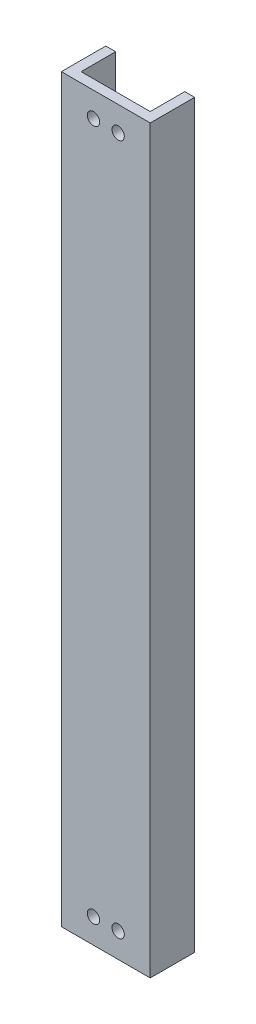
ISO-10303-21;
HEADER;
FILE_DESCRIPTION(('STEP AP214'),'2;1');
FILE_NAME('part.step','',(''),(''),'','','');
FILE_SCHEMA(('AUTOMOTIVE_DESIGN { 1 0 10303 214 1 1 1 1 }'));
ENDSEC;
DATA;
#1=APPLICATION_CONTEXT('core data for automotive mechanical design processes');
#2=APPLICATION_PROTOCOL_DEFINITION('international standard','automotive_design',2000,#1);
#3=PRODUCT_CONTEXT('',#1,'mechanical');
#4=PRODUCT('Part','Part','',(#3));
#5=PRODUCT_RELATED_PRODUCT_CATEGORY('part','',(#4));
#6=PRODUCT_DEFINITION_FORMATION('','',#4);
#7=PRODUCT_DEFINITION_CONTEXT('part definition',#1,'design');
#8=PRODUCT_DEFINITION('design','',#6,#7);
#9=PRODUCT_DEFINITION_SHAPE('','',#8);
#10=(LENGTH_UNIT() NAMED_UNIT(*) SI_UNIT(.MILLI.,.METRE.));
#11=(NAMED_UNIT(*) PLANE_ANGLE_UNIT() SI_UNIT($,.RADIAN.));
#12=(NAMED_UNIT(*) SI_UNIT($,.STERADIAN.) SOLID_ANGLE_UNIT());
#13=UNCERTAINTY_MEASURE_WITH_UNIT(LENGTH_MEASURE(1.E-05),#10,'distance_accuracy_value','');
#14=(GEOMETRIC_REPRESENTATION_CONTEXT(3) GLOBAL_UNCERTAINTY_ASSIGNED_CONTEXT((#13)) GLOBAL_UNIT_ASSIGNED_CONTEXT((#10,
#11,#12)) REPRESENTATION_CONTEXT('',''));
#15=CARTESIAN_POINT('',(0.,0.,0.));
#16=DIRECTION('',(0.,0.,1.));
#17=DIRECTION('',(1.,0.,0.));
#18=AXIS2_PLACEMENT_3D('',#15,#16,#17);
#19=CARTESIAN_POINT('',(9.,150.,-4.5));
#20=DIRECTION('',(-1.,0.,0.));
#21=DIRECTION('',(0.,0.,1.));
#22=AXIS2_PLACEMENT_3D('',#19,#20,#21);
#23=PLANE('',#22);
#24=DIRECTION('',(0.,0.,-1.));
#25=VECTOR('',#24,1.);
#26=CARTESIAN_POINT('',(9.,0.,-4.5));
#27=LINE('',#26,#25);
#28=CARTESIAN_POINT('',(9.,0.,4.5));
#29=VERTEX_POINT('',#28);
#30=CARTESIAN_POINT('',(9.,0.,-4.5));
#31=VERTEX_POINT('',#30);
#32=EDGE_CURVE('E135',#29,#31,#27,.T.);
#33=ORIENTED_EDGE('',*,*,#32,.T.);
#34=DIRECTION('',(0.,-1.,0.));
#35=VECTOR('',#34,1.);
#36=CARTESIAN_POINT('',(9.,150.,-4.5));
#37=LINE('',#36,#35);
#38=CARTESIAN_POINT('',(9.,150.,-4.5));
#39=VERTEX_POINT('',#38);
#40=EDGE_CURVE('E11',#39,#31,#37,.T.);
#41=ORIENTED_EDGE('',*,*,#40,.F.);
#42=DIRECTION('',(0.,0.,-1.));
#43=VECTOR('',#42,1.);
#44=CARTESIAN_POINT('',(9.,150.,-4.5));
#45=LINE('',#44,#43);
#46=CARTESIAN_POINT('',(9.,150.,4.5));
#47=VERTEX_POINT('',#46);
#48=EDGE_CURVE('E149',#47,#39,#45,.T.);
#49=ORIENTED_EDGE('',*,*,#48,.F.);
#50=DIRECTION('',(0.,-1.,0.));
#51=VECTOR('',#50,1.);
#52=CARTESIAN_POINT('',(9.,150.,4.5));
#53=LINE('',#52,#51);
#54=EDGE_CURVE('E131',#47,#29,#53,.T.);
#55=ORIENTED_EDGE('',*,*,#54,.T.);
#56=EDGE_LOOP('',(#33,#41,#49,#55));
#57=FACE_BOUND('',#56,.T.);
#58=ADVANCED_FACE('F37',(#57),#23,.F.);
#59=CARTESIAN_POINT('',(9.,150.,-4.5));
#60=DIRECTION('',(0.,0.,1.));
#61=DIRECTION('',(1.,0.,0.));
#62=AXIS2_PLACEMENT_3D('',#59,#60,#61);
#63=PLANE('',#62);
#64=DIRECTION('',(-1.,0.,0.));
#65=VECTOR('',#64,1.);
#66=CARTESIAN_POINT('',(9.,0.,-4.5));
#67=LINE('',#66,#65);
#68=CARTESIAN_POINT('',(7.,0.,-4.5));
#69=VERTEX_POINT('',#68);
#70=EDGE_CURVE('E138',#31,#69,#67,.T.);
#71=ORIENTED_EDGE('',*,*,#70,.T.);
#72=DIRECTION('',(0.,-1.,0.));
#73=VECTOR('',#72,1.);
#74=CARTESIAN_POINT('',(7.,150.,-4.5));
#75=LINE('',#74,#73);
#76=CARTESIAN_POINT('',(7.,150.,-4.5));
#77=VERTEX_POINT('',#76);
#78=EDGE_CURVE('E46',#77,#69,#75,.T.);
#79=ORIENTED_EDGE('',*,*,#78,.F.);
#80=DIRECTION('',(-1.,0.,0.));
#81=VECTOR('',#80,1.);
#82=CARTESIAN_POINT('',(9.,150.,-4.5));
#83=LINE('',#82,#81);
#84=EDGE_CURVE('E98',#39,#77,#83,.T.);
#85=ORIENTED_EDGE('',*,*,#84,.F.);
#86=ORIENTED_EDGE('',*,*,#40,.T.);
#87=EDGE_LOOP('',(#71,#79,#85,#86));
#88=FACE_BOUND('',#87,.T.);
#89=ADVANCED_FACE('F190',(#88),#63,.F.);
#90=CARTESIAN_POINT('',(7.,150.,-4.5));
#91=DIRECTION('',(1.,0.,0.));
#92=DIRECTION('',(0.,0.,-1.));
#93=AXIS2_PLACEMENT_3D('',#90,#91,#92);
#94=PLANE('',#93);
#95=DIRECTION('',(0.,0.,1.));
#96=VECTOR('',#95,1.);
#97=CARTESIAN_POINT('',(7.,0.,-4.5));
#98=LINE('',#97,#96);
#99=CARTESIAN_POINT('',(7.,0.,2.5));
#100=VERTEX_POINT('',#99);
#101=EDGE_CURVE('E140',#69,#100,#98,.T.);
#102=ORIENTED_EDGE('',*,*,#101,.T.);
#103=DIRECTION('',(0.,-1.,0.));
#104=VECTOR('',#103,1.);
#105=CARTESIAN_POINT('',(7.,150.,2.5));
#106=LINE('',#105,#104);
#107=CARTESIAN_POINT('',(7.,150.,2.5));
#108=VERTEX_POINT('',#107);
#109=EDGE_CURVE('E156',#108,#100,#106,.T.);
#110=ORIENTED_EDGE('',*,*,#109,.F.);
#111=DIRECTION('',(0.,0.,1.));
#112=VECTOR('',#111,1.);
#113=CARTESIAN_POINT('',(7.,150.,-4.5));
#114=LINE('',#113,#112);
#115=EDGE_CURVE('E206',#77,#108,#114,.T.);
#116=ORIENTED_EDGE('',*,*,#115,.F.);
#117=ORIENTED_EDGE('',*,*,#78,.T.);
#118=EDGE_LOOP('',(#102,#110,#116,#117));
#119=FACE_BOUND('',#118,.T.);
#120=ADVANCED_FACE('F195',(#119),#94,.F.);
#121=CARTESIAN_POINT('',(-7.,150.,2.5));
#122=DIRECTION('',(0.,0.,1.));
#123=DIRECTION('',(1.,0.,0.));
#124=AXIS2_PLACEMENT_3D('',#121,#122,#123);
#125=PLANE('',#124);
#126=CARTESIAN_POINT('',(2.49999999999998,145.,2.5));
#127=DIRECTION('',(0.,0.,-1.));
#128=DIRECTION('',(1.,0.,0.));
#129=AXIS2_PLACEMENT_3D('',#126,#127,#128);
#130=CIRCLE('',#129,1.25);
#131=CARTESIAN_POINT('',(3.74999999999998,145.,2.5));
#132=VERTEX_POINT('',#131);
#133=EDGE_CURVE('E217',#132,#132,#130,.T.);
#134=ORIENTED_EDGE('',*,*,#133,.F.);
#135=EDGE_LOOP('',(#134));
#136=FACE_BOUND('',#135,.T.);
#137=CARTESIAN_POINT('',(-2.50000000000002,145.,2.5));
#138=DIRECTION('',(0.,0.,-1.));
#139=DIRECTION('',(1.,0.,0.));
#140=AXIS2_PLACEMENT_3D('',#137,#138,#139);
#141=CIRCLE('',#140,1.25);
#142=CARTESIAN_POINT('',(-1.25000000000002,145.,2.5));
#143=VERTEX_POINT('',#142);
#144=EDGE_CURVE('E219',#143,#143,#141,.T.);
#145=ORIENTED_EDGE('',*,*,#144,.F.);
#146=EDGE_LOOP('',(#145));
#147=FACE_BOUND('',#146,.T.);
#148=CARTESIAN_POINT('',(-2.50000000000002,5.,2.5));
#149=DIRECTION('',(0.,0.,-1.));
#150=DIRECTION('',(-1.,0.,0.));
#151=AXIS2_PLACEMENT_3D('',#148,#149,#150);
#152=CIRCLE('',#151,1.25);
#153=CARTESIAN_POINT('',(-3.75000000000002,5.,2.5));
#154=VERTEX_POINT('',#153);
#155=EDGE_CURVE('E216',#154,#154,#152,.T.);
#156=ORIENTED_EDGE('',*,*,#155,.F.);
#157=EDGE_LOOP('',(#156));
#158=FACE_BOUND('',#157,.T.);
#159=CARTESIAN_POINT('',(2.49999999999998,5.,2.5));
#160=DIRECTION('',(0.,0.,-1.));
#161=DIRECTION('',(-1.,0.,0.));
#162=AXIS2_PLACEMENT_3D('',#159,#160,#161);
#163=CIRCLE('',#162,1.25);
#164=CARTESIAN_POINT('',(1.24999999999998,5.,2.5));
#165=VERTEX_POINT('',#164);
#166=EDGE_CURVE('E165',#165,#165,#163,.T.);
#167=ORIENTED_EDGE('',*,*,#166,.F.);
#168=EDGE_LOOP('',(#167));
#169=FACE_BOUND('',#168,.T.);
#170=DIRECTION('',(-1.,0.,0.));
#171=VECTOR('',#170,1.);
#172=CARTESIAN_POINT('',(-7.,0.,2.5));
#173=LINE('',#172,#171);
#174=CARTESIAN_POINT('',(-7.,0.,2.5));
#175=VERTEX_POINT('',#174);
#176=EDGE_CURVE('E142',#100,#175,#173,.T.);
#177=ORIENTED_EDGE('',*,*,#176,.T.);
#178=DIRECTION('',(0.,-1.,0.));
#179=VECTOR('',#178,1.);
#180=CARTESIAN_POINT('',(-7.,150.,2.5));
#181=LINE('',#180,#179);
#182=CARTESIAN_POINT('',(-7.,150.,2.5));
#183=VERTEX_POINT('',#182);
#184=EDGE_CURVE('E153',#183,#175,#181,.T.);
#185=ORIENTED_EDGE('',*,*,#184,.F.);
#186=DIRECTION('',(-1.,0.,0.));
#187=VECTOR('',#186,1.);
#188=CARTESIAN_POINT('',(-7.,150.,2.5));
#189=LINE('',#188,#187);
#190=EDGE_CURVE('E208',#108,#183,#189,.T.);
#191=ORIENTED_EDGE('',*,*,#190,.F.);
#192=ORIENTED_EDGE('',*,*,#109,.T.);
#193=EDGE_LOOP('',(#177,#185,#191,#192));
#194=FACE_BOUND('',#193,.T.);
#195=ADVANCED_FACE('F227',(#136,#147,#158,#169,#194),#125,.F.);
#196=CARTESIAN_POINT('',(-7.,150.,-4.5));
#197=DIRECTION('',(-1.,0.,0.));
#198=DIRECTION('',(0.,0.,1.));
#199=AXIS2_PLACEMENT_3D('',#196,#197,#198);
#200=PLANE('',#199);
#201=DIRECTION('',(0.,0.,-1.));
#202=VECTOR('',#201,1.);
#203=CARTESIAN_POINT('',(-7.,0.,-4.5));
#204=LINE('',#203,#202);
#205=CARTESIAN_POINT('',(-7.,0.,-4.5));
#206=VERTEX_POINT('',#205);
#207=EDGE_CURVE('E144',#175,#206,#204,.T.);
#208=ORIENTED_EDGE('',*,*,#207,.T.);
#209=DIRECTION('',(0.,-1.,0.));
#210=VECTOR('',#209,1.);
#211=CARTESIAN_POINT('',(-7.,150.,-4.5));
#212=LINE('',#211,#210);
#213=CARTESIAN_POINT('',(-7.,150.,-4.5));
#214=VERTEX_POINT('',#213);
#215=EDGE_CURVE('E126',#214,#206,#212,.T.);
#216=ORIENTED_EDGE('',*,*,#215,.F.);
#217=DIRECTION('',(0.,0.,-1.));
#218=VECTOR('',#217,1.);
#219=CARTESIAN_POINT('',(-7.,150.,-4.5));
#220=LINE('',#219,#218);
#221=EDGE_CURVE('E117',#183,#214,#220,.T.);
#222=ORIENTED_EDGE('',*,*,#221,.F.);
#223=ORIENTED_EDGE('',*,*,#184,.T.);
#224=EDGE_LOOP('',(#208,#216,#222,#223));
#225=FACE_BOUND('',#224,.T.);
#226=ADVANCED_FACE('F230',(#225),#200,.F.);
#227=CARTESIAN_POINT('',(-9.,150.,-4.5));
#228=DIRECTION('',(0.,0.,1.));
#229=DIRECTION('',(1.,0.,0.));
#230=AXIS2_PLACEMENT_3D('',#227,#228,#229);
#231=PLANE('',#230);
#232=DIRECTION('',(-1.,0.,0.));
#233=VECTOR('',#232,1.);
#234=CARTESIAN_POINT('',(-9.,0.,-4.5));
#235=LINE('',#234,#233);
#236=CARTESIAN_POINT('',(-9.,0.,-4.5));
#237=VERTEX_POINT('',#236);
#238=EDGE_CURVE('E125',#206,#237,#235,.T.);
#239=ORIENTED_EDGE('',*,*,#238,.T.);
#240=DIRECTION('',(0.,-1.,0.));
#241=VECTOR('',#240,1.);
#242=CARTESIAN_POINT('',(-9.,150.,-4.5));
#243=LINE('',#242,#241);
#244=CARTESIAN_POINT('',(-9.,150.,-4.5));
#245=VERTEX_POINT('',#244);
#246=EDGE_CURVE('E122',#245,#237,#243,.T.);
#247=ORIENTED_EDGE('',*,*,#246,.F.);
#248=DIRECTION('',(-1.,0.,0.));
#249=VECTOR('',#248,1.);
#250=CARTESIAN_POINT('',(-9.,150.,-4.5));
#251=LINE('',#250,#249);
#252=EDGE_CURVE('E111',#214,#245,#251,.T.);
#253=ORIENTED_EDGE('',*,*,#252,.F.);
#254=ORIENTED_EDGE('',*,*,#215,.T.);
#255=EDGE_LOOP('',(#239,#247,#253,#254));
#256=FACE_BOUND('',#255,.T.);
#257=ADVANCED_FACE('F123',(#256),#231,.F.);
#258=CARTESIAN_POINT('',(-9.,150.,-4.5));
#259=DIRECTION('',(1.,0.,0.));
#260=DIRECTION('',(0.,0.,-1.));
#261=AXIS2_PLACEMENT_3D('',#258,#259,#260);
#262=PLANE('',#261);
#263=DIRECTION('',(0.,0.,1.));
#264=VECTOR('',#263,1.);
#265=CARTESIAN_POINT('',(-9.,0.,-4.5));
#266=LINE('',#265,#264);
#267=CARTESIAN_POINT('',(-9.,0.,4.5));
#268=VERTEX_POINT('',#267);
#269=EDGE_CURVE('E84',#237,#268,#266,.T.);
#270=ORIENTED_EDGE('',*,*,#269,.T.);
#271=DIRECTION('',(0.,-1.,0.));
#272=VECTOR('',#271,1.);
#273=CARTESIAN_POINT('',(-9.,150.,4.5));
#274=LINE('',#273,#272);
#275=CARTESIAN_POINT('',(-9.,150.,4.5));
#276=VERTEX_POINT('',#275);
#277=EDGE_CURVE('E127',#276,#268,#274,.T.);
#278=ORIENTED_EDGE('',*,*,#277,.F.);
#279=DIRECTION('',(0.,0.,1.));
#280=VECTOR('',#279,1.);
#281=CARTESIAN_POINT('',(-9.,150.,-4.5));
#282=LINE('',#281,#280);
#283=EDGE_CURVE('E115',#245,#276,#282,.T.);
#284=ORIENTED_EDGE('',*,*,#283,.F.);
#285=ORIENTED_EDGE('',*,*,#246,.T.);
#286=EDGE_LOOP('',(#270,#278,#284,#285));
#287=FACE_BOUND('',#286,.T.);
#288=ADVANCED_FACE('F129',(#287),#262,.F.);
#289=CARTESIAN_POINT('',(-9.,150.,4.5));
#290=DIRECTION('',(0.,0.,-1.));
#291=DIRECTION('',(-1.,0.,0.));
#292=AXIS2_PLACEMENT_3D('',#289,#290,#291);
#293=PLANE('',#292);
#294=CARTESIAN_POINT('',(2.49999999999998,145.,4.5));
#295=DIRECTION('',(0.,0.,-1.));
#296=DIRECTION('',(-1.,0.,0.));
#297=AXIS2_PLACEMENT_3D('',#294,#295,#296);
#298=CIRCLE('',#297,1.25);
#299=CARTESIAN_POINT('',(1.24999999999998,145.,4.5));
#300=VERTEX_POINT('',#299);
#301=EDGE_CURVE('E40',#300,#300,#298,.T.);
#302=ORIENTED_EDGE('',*,*,#301,.T.);
#303=EDGE_LOOP('',(#302));
#304=FACE_BOUND('',#303,.T.);
#305=CARTESIAN_POINT('',(-2.50000000000002,145.,4.5));
#306=DIRECTION('',(0.,0.,-1.));
#307=DIRECTION('',(-1.,0.,0.));
#308=AXIS2_PLACEMENT_3D('',#305,#306,#307);
#309=CIRCLE('',#308,1.25);
#310=CARTESIAN_POINT('',(-3.75000000000002,145.,4.5));
#311=VERTEX_POINT('',#310);
#312=EDGE_CURVE('E167',#311,#311,#309,.T.);
#313=ORIENTED_EDGE('',*,*,#312,.T.);
#314=EDGE_LOOP('',(#313));
#315=FACE_BOUND('',#314,.T.);
#316=CARTESIAN_POINT('',(-2.50000000000002,5.,4.5));
#317=DIRECTION('',(0.,0.,-1.));
#318=DIRECTION('',(-1.,0.,0.));
#319=AXIS2_PLACEMENT_3D('',#316,#317,#318);
#320=CIRCLE('',#319,1.25);
#321=CARTESIAN_POINT('',(-3.75000000000002,5.,4.5));
#322=VERTEX_POINT('',#321);
#323=EDGE_CURVE('E164',#322,#322,#320,.T.);
#324=ORIENTED_EDGE('',*,*,#323,.T.);
#325=EDGE_LOOP('',(#324));
#326=FACE_BOUND('',#325,.T.);
#327=CARTESIAN_POINT('',(2.49999999999998,5.,4.5));
#328=DIRECTION('',(0.,0.,-1.));
#329=DIRECTION('',(-1.,0.,0.));
#330=AXIS2_PLACEMENT_3D('',#327,#328,#329);
#331=CIRCLE('',#330,1.25);
#332=CARTESIAN_POINT('',(1.24999999999998,5.,4.5));
#333=VERTEX_POINT('',#332);
#334=EDGE_CURVE('E161',#333,#333,#331,.T.);
#335=ORIENTED_EDGE('',*,*,#334,.T.);
#336=EDGE_LOOP('',(#335));
#337=FACE_BOUND('',#336,.T.);
#338=DIRECTION('',(1.,0.,0.));
#339=VECTOR('',#338,1.);
#340=CARTESIAN_POINT('',(-9.,0.,4.5));
#341=LINE('',#340,#339);
#342=EDGE_CURVE('E90',#268,#29,#341,.T.);
#343=ORIENTED_EDGE('',*,*,#342,.T.);
#344=ORIENTED_EDGE('',*,*,#54,.F.);
#345=DIRECTION('',(1.,0.,0.));
#346=VECTOR('',#345,1.);
#347=CARTESIAN_POINT('',(-9.,150.,4.5));
#348=LINE('',#347,#346);
#349=EDGE_CURVE('E55',#276,#47,#348,.T.);
#350=ORIENTED_EDGE('',*,*,#349,.F.);
#351=ORIENTED_EDGE('',*,*,#277,.T.);
#352=EDGE_LOOP('',(#343,#344,#350,#351));
#353=FACE_BOUND('',#352,.T.);
#354=ADVANCED_FACE('F174',(#304,#315,#326,#337,#353),#293,.F.);
#355=CARTESIAN_POINT('',(0.,150.,0.));
#356=DIRECTION('',(0.,1.,0.));
#357=DIRECTION('',(0.,0.,1.));
#358=AXIS2_PLACEMENT_3D('',#355,#356,#357);
#359=PLANE('',#358);
#360=ORIENTED_EDGE('',*,*,#48,.T.);
#361=ORIENTED_EDGE('',*,*,#84,.T.);
#362=ORIENTED_EDGE('',*,*,#115,.T.);
#363=ORIENTED_EDGE('',*,*,#190,.T.);
#364=ORIENTED_EDGE('',*,*,#221,.T.);
#365=ORIENTED_EDGE('',*,*,#252,.T.);
#366=ORIENTED_EDGE('',*,*,#283,.T.);
#367=ORIENTED_EDGE('',*,*,#349,.T.);
#368=EDGE_LOOP('',(#360,#361,#362,#363,#364,#365,#366,#367));
#369=FACE_BOUND('',#368,.T.);
#370=ADVANCED_FACE('F113',(#369),#359,.T.);
#371=CARTESIAN_POINT('',(0.,0.,0.));
#372=DIRECTION('',(0.,1.,0.));
#373=DIRECTION('',(0.,0.,1.));
#374=AXIS2_PLACEMENT_3D('',#371,#372,#373);
#375=PLANE('',#374);
#376=ORIENTED_EDGE('',*,*,#32,.F.);
#377=ORIENTED_EDGE('',*,*,#342,.F.);
#378=ORIENTED_EDGE('',*,*,#269,.F.);
#379=ORIENTED_EDGE('',*,*,#238,.F.);
#380=ORIENTED_EDGE('',*,*,#207,.F.);
#381=ORIENTED_EDGE('',*,*,#176,.F.);
#382=ORIENTED_EDGE('',*,*,#101,.F.);
#383=ORIENTED_EDGE('',*,*,#70,.F.);
#384=EDGE_LOOP('',(#376,#377,#378,#379,#380,#381,#382,#383));
#385=FACE_BOUND('',#384,.T.);
#386=ADVANCED_FACE('F200',(#385),#375,.F.);
#387=CARTESIAN_POINT('',(2.49999999999998,5.,12.5));
#388=DIRECTION('',(0.,0.,-1.));
#389=DIRECTION('',(-1.,0.,0.));
#390=AXIS2_PLACEMENT_3D('',#387,#388,#389);
#391=CYLINDRICAL_SURFACE('',#390,1.25);
#392=ORIENTED_EDGE('',*,*,#166,.T.);
#393=EDGE_LOOP('',(#392));
#394=FACE_BOUND('',#393,.T.);
#395=ORIENTED_EDGE('',*,*,#334,.F.);
#396=EDGE_LOOP('',(#395));
#397=FACE_BOUND('',#396,.T.);
#398=ADVANCED_FACE('F278',(#394,#397),#391,.F.);
#399=CARTESIAN_POINT('',(-2.50000000000002,5.,12.5));
#400=DIRECTION('',(0.,0.,-1.));
#401=DIRECTION('',(-1.,0.,0.));
#402=AXIS2_PLACEMENT_3D('',#399,#400,#401);
#403=CYLINDRICAL_SURFACE('',#402,1.25);
#404=ORIENTED_EDGE('',*,*,#155,.T.);
#405=EDGE_LOOP('',(#404));
#406=FACE_BOUND('',#405,.T.);
#407=ORIENTED_EDGE('',*,*,#323,.F.);
#408=EDGE_LOOP('',(#407));
#409=FACE_BOUND('',#408,.T.);
#410=ADVANCED_FACE('F184',(#406,#409),#403,.F.);
#411=CARTESIAN_POINT('',(-2.50000000000002,145.,12.5));
#412=DIRECTION('',(0.,0.,-1.));
#413=DIRECTION('',(-1.,0.,0.));
#414=AXIS2_PLACEMENT_3D('',#411,#412,#413);
#415=CYLINDRICAL_SURFACE('',#414,1.25);
#416=ORIENTED_EDGE('',*,*,#144,.T.);
#417=EDGE_LOOP('',(#416));
#418=FACE_BOUND('',#417,.T.);
#419=ORIENTED_EDGE('',*,*,#312,.F.);
#420=EDGE_LOOP('',(#419));
#421=FACE_BOUND('',#420,.T.);
#422=ADVANCED_FACE('F178',(#418,#421),#415,.F.);
#423=CARTESIAN_POINT('',(2.49999999999998,145.,12.5));
#424=DIRECTION('',(0.,0.,-1.));
#425=DIRECTION('',(-1.,0.,0.));
#426=AXIS2_PLACEMENT_3D('',#423,#424,#425);
#427=CYLINDRICAL_SURFACE('',#426,1.25);
#428=ORIENTED_EDGE('',*,*,#133,.T.);
#429=EDGE_LOOP('',(#428));
#430=FACE_BOUND('',#429,.T.);
#431=ORIENTED_EDGE('',*,*,#301,.F.);
#432=EDGE_LOOP('',(#431));
#433=FACE_BOUND('',#432,.T.);
#434=ADVANCED_FACE('F176',(#430,#433),#427,.F.);
#435=CLOSED_SHELL('',(#58,#89,#120,#195,#226,#257,#288,#354,#370,#386,#398,#410,#422,#434));
#436=MANIFOLD_SOLID_BREP('B2',#435);
#437=ADVANCED_BREP_SHAPE_REPRESENTATION('',(#18,#436),#14);
#438=SHAPE_DEFINITION_REPRESENTATION(#9,#437);
ENDSEC;
END-ISO-10303-21;
